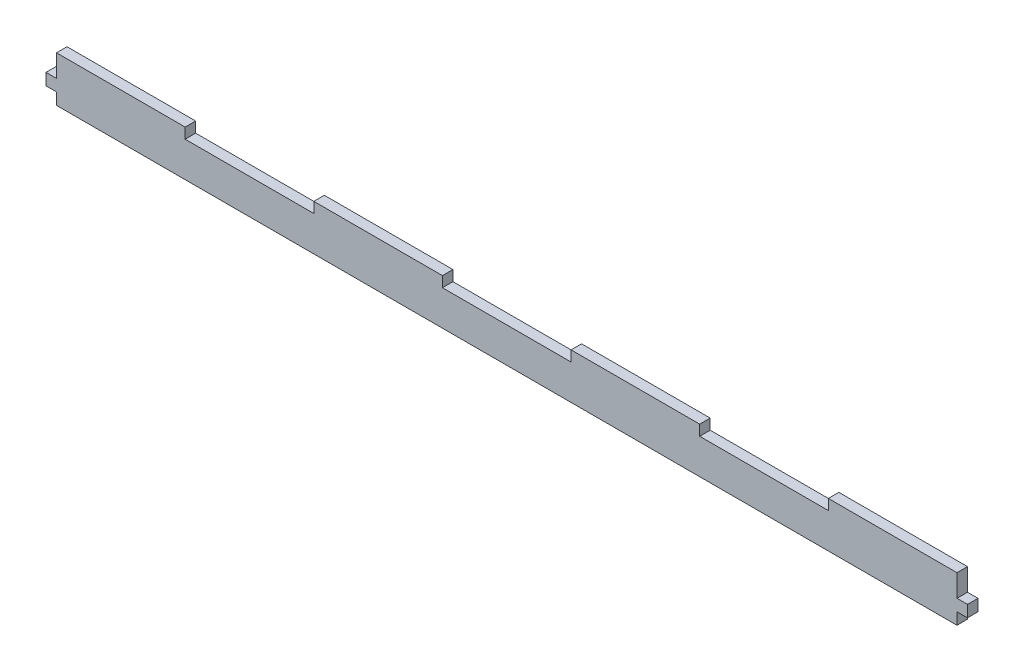
ISO-10303-21;
HEADER;
FILE_DESCRIPTION(('STEP AP214'),'2;1');
FILE_NAME('part.step','',(''),(''),'','','');
FILE_SCHEMA(('AUTOMOTIVE_DESIGN { 1 0 10303 214 1 1 1 1 }'));
ENDSEC;
DATA;
#1=APPLICATION_CONTEXT('core data for automotive mechanical design processes');
#2=APPLICATION_PROTOCOL_DEFINITION('international standard','automotive_design',2000,#1);
#3=PRODUCT_CONTEXT('',#1,'mechanical');
#4=PRODUCT('Part','Part','',(#3));
#5=PRODUCT_RELATED_PRODUCT_CATEGORY('part','',(#4));
#6=PRODUCT_DEFINITION_FORMATION('','',#4);
#7=PRODUCT_DEFINITION_CONTEXT('part definition',#1,'design');
#8=PRODUCT_DEFINITION('design','',#6,#7);
#9=PRODUCT_DEFINITION_SHAPE('','',#8);
#10=(LENGTH_UNIT() NAMED_UNIT(*) SI_UNIT(.MILLI.,.METRE.));
#11=(NAMED_UNIT(*) PLANE_ANGLE_UNIT() SI_UNIT($,.RADIAN.));
#12=(NAMED_UNIT(*) SI_UNIT($,.STERADIAN.) SOLID_ANGLE_UNIT());
#13=UNCERTAINTY_MEASURE_WITH_UNIT(LENGTH_MEASURE(1.E-05),#10,'distance_accuracy_value','');
#14=(GEOMETRIC_REPRESENTATION_CONTEXT(3) GLOBAL_UNCERTAINTY_ASSIGNED_CONTEXT((#13)) GLOBAL_UNIT_ASSIGNED_CONTEXT((#10,
#11,#12)) REPRESENTATION_CONTEXT('',''));
#15=CARTESIAN_POINT('',(0.,0.,0.));
#16=DIRECTION('',(0.,0.,1.));
#17=DIRECTION('',(1.,0.,0.));
#18=AXIS2_PLACEMENT_3D('',#15,#16,#17);
#19=CARTESIAN_POINT('',(257.,-14.,0.));
#20=DIRECTION('',(1.,0.,0.));
#21=DIRECTION('',(0.,0.,-1.));
#22=AXIS2_PLACEMENT_3D('',#19,#20,#21);
#23=PLANE('',#22);
#24=DIRECTION('',(0.,0.,1.));
#25=VECTOR('',#24,1.);
#26=CARTESIAN_POINT('',(257.,-0.666666666666655,0.));
#27=LINE('',#26,#25);
#28=CARTESIAN_POINT('',(257.,-0.666666666666668,-93.25));
#29=VERTEX_POINT('',#28);
#30=CARTESIAN_POINT('',(257.,-0.666666666666668,-87.25));
#31=VERTEX_POINT('',#30);
#32=EDGE_CURVE('E224',#29,#31,#27,.T.);
#33=ORIENTED_EDGE('',*,*,#32,.F.);
#34=DIRECTION('',(0.,1.,0.));
#35=VECTOR('',#34,1.);
#36=CARTESIAN_POINT('',(257.,-14.,-93.25));
#37=LINE('',#36,#35);
#38=CARTESIAN_POINT('',(257.,12.,-93.25));
#39=VERTEX_POINT('',#38);
#40=EDGE_CURVE('E449',#29,#39,#37,.T.);
#41=ORIENTED_EDGE('',*,*,#40,.T.);
#42=DIRECTION('',(0.,0.,-1.));
#43=VECTOR('',#42,1.);
#44=CARTESIAN_POINT('',(257.,12.,0.));
#45=LINE('',#44,#43);
#46=CARTESIAN_POINT('',(257.,12.,-87.25));
#47=VERTEX_POINT('',#46);
#48=EDGE_CURVE('E295',#47,#39,#45,.T.);
#49=ORIENTED_EDGE('',*,*,#48,.F.);
#50=DIRECTION('',(0.,1.,0.));
#51=VECTOR('',#50,1.);
#52=CARTESIAN_POINT('',(257.,-14.,-87.25));
#53=LINE('',#52,#51);
#54=EDGE_CURVE('E63',#31,#47,#53,.T.);
#55=ORIENTED_EDGE('',*,*,#54,.F.);
#56=EDGE_LOOP('',(#33,#41,#49,#55));
#57=FACE_BOUND('',#56,.T.);
#58=ADVANCED_FACE('F45',(#57),#23,.T.);
#59=CARTESIAN_POINT('',(-257.,-14.,0.));
#60=DIRECTION('',(-1.,0.,0.));
#61=DIRECTION('',(0.,0.,1.));
#62=AXIS2_PLACEMENT_3D('',#59,#60,#61);
#63=PLANE('',#62);
#64=DIRECTION('',(0.,1.,0.));
#65=VECTOR('',#64,1.);
#66=CARTESIAN_POINT('',(-257.,-14.,-93.2499999999999));
#67=LINE('',#66,#65);
#68=CARTESIAN_POINT('',(-257.,-0.666666666666669,-93.2499999999999));
#69=VERTEX_POINT('',#68);
#70=CARTESIAN_POINT('',(-257.,12.,-93.2499999999999));
#71=VERTEX_POINT('',#70);
#72=EDGE_CURVE('E446',#69,#71,#67,.T.);
#73=ORIENTED_EDGE('',*,*,#72,.F.);
#74=DIRECTION('',(0.,0.,1.));
#75=VECTOR('',#74,1.);
#76=CARTESIAN_POINT('',(-257.,-0.666666666666655,0.));
#77=LINE('',#76,#75);
#78=CARTESIAN_POINT('',(-257.,-0.666666666666668,-87.2499999999999));
#79=VERTEX_POINT('',#78);
#80=EDGE_CURVE('E227',#69,#79,#77,.T.);
#81=ORIENTED_EDGE('',*,*,#80,.T.);
#82=DIRECTION('',(0.,1.,0.));
#83=VECTOR('',#82,1.);
#84=CARTESIAN_POINT('',(-257.,-14.,-87.2499999999999));
#85=LINE('',#84,#83);
#86=CARTESIAN_POINT('',(-257.,12.,-87.2499999999999));
#87=VERTEX_POINT('',#86);
#88=EDGE_CURVE('E55',#79,#87,#85,.T.);
#89=ORIENTED_EDGE('',*,*,#88,.T.);
#90=DIRECTION('',(0.,0.,1.));
#91=VECTOR('',#90,1.);
#92=CARTESIAN_POINT('',(-257.,12.,0.));
#93=LINE('',#92,#91);
#94=EDGE_CURVE('E399',#71,#87,#93,.T.);
#95=ORIENTED_EDGE('',*,*,#94,.F.);
#96=EDGE_LOOP('',(#73,#81,#89,#95));
#97=FACE_BOUND('',#96,.T.);
#98=ADVANCED_FACE('F508',(#97),#63,.T.);
#99=CARTESIAN_POINT('',(-257.,-14.,-87.2499999999999));
#100=VERTEX_POINT('',#99);
#101=CARTESIAN_POINT('',(-257.,-7.33333333333333,-87.2499999999999));
#102=VERTEX_POINT('',#101);
#103=EDGE_CURVE('E11',#100,#102,#85,.T.);
#104=ORIENTED_EDGE('',*,*,#103,.T.);
#105=DIRECTION('',(0.,0.,-1.));
#106=VECTOR('',#105,1.);
#107=CARTESIAN_POINT('',(-257.,-7.33333333333333,0.));
#108=LINE('',#107,#106);
#109=CARTESIAN_POINT('',(-257.,-7.33333333333333,-93.2499999999999));
#110=VERTEX_POINT('',#109);
#111=EDGE_CURVE('E258',#102,#110,#108,.T.);
#112=ORIENTED_EDGE('',*,*,#111,.T.);
#113=CARTESIAN_POINT('',(-257.,-14.,-93.2499999999999));
#114=VERTEX_POINT('',#113);
#115=EDGE_CURVE('E443',#114,#110,#67,.T.);
#116=ORIENTED_EDGE('',*,*,#115,.F.);
#117=DIRECTION('',(0.,0.,1.));
#118=VECTOR('',#117,1.);
#119=CARTESIAN_POINT('',(-257.,-14.,0.));
#120=LINE('',#119,#118);
#121=EDGE_CURVE('E431',#114,#100,#120,.T.);
#122=ORIENTED_EDGE('',*,*,#121,.T.);
#123=EDGE_LOOP('',(#104,#112,#116,#122));
#124=FACE_BOUND('',#123,.T.);
#125=ADVANCED_FACE('F523',(#124),#63,.T.);
#126=CARTESIAN_POINT('',(0.,6.,0.));
#127=DIRECTION('',(0.,1.,0.));
#128=DIRECTION('',(0.,0.,1.));
#129=AXIS2_PLACEMENT_3D('',#126,#127,#128);
#130=PLANE('',#129);
#131=DIRECTION('',(0.,0.,-1.));
#132=VECTOR('',#131,1.);
#133=CARTESIAN_POINT('',(36.7142857142858,6.,0.));
#134=LINE('',#133,#132);
#135=CARTESIAN_POINT('',(36.7142857142858,6.,-87.25));
#136=VERTEX_POINT('',#135);
#137=CARTESIAN_POINT('',(36.7142857142858,6.,-93.25));
#138=VERTEX_POINT('',#137);
#139=EDGE_CURVE('E312',#136,#138,#134,.T.);
#140=ORIENTED_EDGE('',*,*,#139,.T.);
#141=DIRECTION('',(-1.,0.,0.));
#142=VECTOR('',#141,1.);
#143=CARTESIAN_POINT('',(0.,6.,-93.25));
#144=LINE('',#143,#142);
#145=CARTESIAN_POINT('',(-36.7142857142856,6.,-93.25));
#146=VERTEX_POINT('',#145);
#147=EDGE_CURVE('E441',#138,#146,#144,.T.);
#148=ORIENTED_EDGE('',*,*,#147,.T.);
#149=DIRECTION('',(0.,0.,1.));
#150=VECTOR('',#149,1.);
#151=CARTESIAN_POINT('',(-36.7142857142852,6.,1.69837688886108E-13));
#152=LINE('',#151,#150);
#153=CARTESIAN_POINT('',(-36.7142857142856,6.,-87.25));
#154=VERTEX_POINT('',#153);
#155=EDGE_CURVE('E357',#146,#154,#152,.T.);
#156=ORIENTED_EDGE('',*,*,#155,.T.);
#157=DIRECTION('',(-1.,0.,0.));
#158=VECTOR('',#157,1.);
#159=CARTESIAN_POINT('',(0.,6.,-87.25));
#160=LINE('',#159,#158);
#161=EDGE_CURVE('E439',#136,#154,#160,.T.);
#162=ORIENTED_EDGE('',*,*,#161,.F.);
#163=EDGE_LOOP('',(#140,#148,#156,#162));
#164=FACE_BOUND('',#163,.T.);
#165=ADVANCED_FACE('F482',(#164),#130,.T.);
#166=DIRECTION('',(0.,0.,-1.));
#167=VECTOR('',#166,1.);
#168=CARTESIAN_POINT('',(-110.142857142857,6.,0.));
#169=LINE('',#168,#167);
#170=CARTESIAN_POINT('',(-110.142857142857,6.,-87.25));
#171=VERTEX_POINT('',#170);
#172=CARTESIAN_POINT('',(-110.142857142857,6.,-93.2499999999999));
#173=VERTEX_POINT('',#172);
#174=EDGE_CURVE('E351',#171,#173,#169,.T.);
#175=ORIENTED_EDGE('',*,*,#174,.T.);
#176=CARTESIAN_POINT('',(-183.571428571428,6.,-93.2499999999999));
#177=VERTEX_POINT('',#176);
#178=EDGE_CURVE('E438',#173,#177,#144,.T.);
#179=ORIENTED_EDGE('',*,*,#178,.T.);
#180=DIRECTION('',(0.,0.,1.));
#181=VECTOR('',#180,1.);
#182=CARTESIAN_POINT('',(-183.571428571428,6.,0.));
#183=LINE('',#182,#181);
#184=CARTESIAN_POINT('',(-183.571428571428,6.,-87.2499999999999));
#185=VERTEX_POINT('',#184);
#186=EDGE_CURVE('E390',#177,#185,#183,.T.);
#187=ORIENTED_EDGE('',*,*,#186,.T.);
#188=EDGE_CURVE('E418',#171,#185,#160,.T.);
#189=ORIENTED_EDGE('',*,*,#188,.F.);
#190=EDGE_LOOP('',(#175,#179,#187,#189));
#191=FACE_BOUND('',#190,.T.);
#192=ADVANCED_FACE('F493',(#191),#130,.T.);
#193=DIRECTION('',(0.,0.,-1.));
#194=VECTOR('',#193,1.);
#195=CARTESIAN_POINT('',(183.571428571429,6.,0.));
#196=LINE('',#195,#194);
#197=CARTESIAN_POINT('',(183.571428571429,6.,-87.25));
#198=VERTEX_POINT('',#197);
#199=CARTESIAN_POINT('',(183.571428571429,6.,-93.25));
#200=VERTEX_POINT('',#199);
#201=EDGE_CURVE('E286',#198,#200,#196,.T.);
#202=ORIENTED_EDGE('',*,*,#201,.T.);
#203=CARTESIAN_POINT('',(110.142857142857,6.,-93.25));
#204=VERTEX_POINT('',#203);
#205=EDGE_CURVE('E423',#200,#204,#144,.T.);
#206=ORIENTED_EDGE('',*,*,#205,.T.);
#207=DIRECTION('',(0.,0.,1.));
#208=VECTOR('',#207,1.);
#209=CARTESIAN_POINT('',(110.142857142857,6.,0.));
#210=LINE('',#209,#208);
#211=CARTESIAN_POINT('',(110.142857142857,6.,-87.25));
#212=VERTEX_POINT('',#211);
#213=EDGE_CURVE('E318',#204,#212,#210,.T.);
#214=ORIENTED_EDGE('',*,*,#213,.T.);
#215=EDGE_CURVE('E435',#198,#212,#160,.T.);
#216=ORIENTED_EDGE('',*,*,#215,.F.);
#217=EDGE_LOOP('',(#202,#206,#214,#216));
#218=FACE_BOUND('',#217,.T.);
#219=ADVANCED_FACE('F468',(#218),#130,.T.);
#220=CARTESIAN_POINT('',(0.,-14.,-87.25));
#221=DIRECTION('',(0.,0.,-1.));
#222=DIRECTION('',(-1.,0.,0.));
#223=AXIS2_PLACEMENT_3D('',#220,#221,#222);
#224=PLANE('',#223);
#225=CARTESIAN_POINT('',(257.,-14.,-87.25));
#226=VERTEX_POINT('',#225);
#227=CARTESIAN_POINT('',(257.,-7.33333333333333,-87.25));
#228=VERTEX_POINT('',#227);
#229=EDGE_CURVE('E49',#226,#228,#53,.T.);
#230=ORIENTED_EDGE('',*,*,#229,.T.);
#231=DIRECTION('',(-1.,0.,0.));
#232=VECTOR('',#231,1.);
#233=CARTESIAN_POINT('',(263.,-7.33333333333333,-87.2499999999999));
#234=LINE('',#233,#232);
#235=CARTESIAN_POINT('',(263.,-7.33333333333333,-87.2499999999999));
#236=VERTEX_POINT('',#235);
#237=EDGE_CURVE('E228',#236,#228,#234,.T.);
#238=ORIENTED_EDGE('',*,*,#237,.F.);
#239=DIRECTION('',(0.,1.,0.));
#240=VECTOR('',#239,1.);
#241=CARTESIAN_POINT('',(263.,0.,-87.2499999999999));
#242=LINE('',#241,#240);
#243=CARTESIAN_POINT('',(263.,-0.666666666666668,-87.2499999999999));
#244=VERTEX_POINT('',#243);
#245=EDGE_CURVE('E214',#236,#244,#242,.T.);
#246=ORIENTED_EDGE('',*,*,#245,.T.);
#247=DIRECTION('',(-1.,0.,0.));
#248=VECTOR('',#247,1.);
#249=CARTESIAN_POINT('',(263.,-0.666666666666668,-87.2499999999999));
#250=LINE('',#249,#248);
#251=EDGE_CURVE('E222',#244,#31,#250,.T.);
#252=ORIENTED_EDGE('',*,*,#251,.T.);
#253=ORIENTED_EDGE('',*,*,#54,.T.);
#254=DIRECTION('',(-1.,0.,0.));
#255=VECTOR('',#254,1.);
#256=CARTESIAN_POINT('',(0.,12.,-87.25));
#257=LINE('',#256,#255);
#258=CARTESIAN_POINT('',(183.571428571429,12.,-87.25));
#259=VERTEX_POINT('',#258);
#260=EDGE_CURVE('E291',#47,#259,#257,.T.);
#261=ORIENTED_EDGE('',*,*,#260,.T.);
#262=DIRECTION('',(0.,-1.,0.));
#263=VECTOR('',#262,1.);
#264=CARTESIAN_POINT('',(183.571428571429,12.,-87.25));
#265=LINE('',#264,#263);
#266=EDGE_CURVE('E308',#259,#198,#265,.T.);
#267=ORIENTED_EDGE('',*,*,#266,.T.);
#268=ORIENTED_EDGE('',*,*,#215,.T.);
#269=DIRECTION('',(0.,-1.,0.));
#270=VECTOR('',#269,1.);
#271=CARTESIAN_POINT('',(110.142857142857,12.,-87.25));
#272=LINE('',#271,#270);
#273=CARTESIAN_POINT('',(110.142857142857,12.,-87.25));
#274=VERTEX_POINT('',#273);
#275=EDGE_CURVE('E343',#274,#212,#272,.T.);
#276=ORIENTED_EDGE('',*,*,#275,.F.);
#277=DIRECTION('',(-1.,0.,0.));
#278=VECTOR('',#277,1.);
#279=CARTESIAN_POINT('',(0.,12.,-87.25));
#280=LINE('',#279,#278);
#281=CARTESIAN_POINT('',(36.7142857142858,12.,-87.25));
#282=VERTEX_POINT('',#281);
#283=EDGE_CURVE('E317',#274,#282,#280,.T.);
#284=ORIENTED_EDGE('',*,*,#283,.T.);
#285=DIRECTION('',(0.,-1.,0.));
#286=VECTOR('',#285,1.);
#287=CARTESIAN_POINT('',(36.7142857142858,12.,-87.25));
#288=LINE('',#287,#286);
#289=EDGE_CURVE('E347',#282,#136,#288,.T.);
#290=ORIENTED_EDGE('',*,*,#289,.T.);
#291=ORIENTED_EDGE('',*,*,#161,.T.);
#292=DIRECTION('',(0.,-1.,0.));
#293=VECTOR('',#292,1.);
#294=CARTESIAN_POINT('',(-36.7142857142856,12.,-87.25));
#295=LINE('',#294,#293);
#296=CARTESIAN_POINT('',(-36.7142857142856,12.,-87.25));
#297=VERTEX_POINT('',#296);
#298=EDGE_CURVE('E382',#297,#154,#295,.T.);
#299=ORIENTED_EDGE('',*,*,#298,.F.);
#300=DIRECTION('',(-1.,0.,0.));
#301=VECTOR('',#300,1.);
#302=CARTESIAN_POINT('',(0.,12.,-87.25));
#303=LINE('',#302,#301);
#304=CARTESIAN_POINT('',(-110.142857142857,12.,-87.25));
#305=VERTEX_POINT('',#304);
#306=EDGE_CURVE('E356',#297,#305,#303,.T.);
#307=ORIENTED_EDGE('',*,*,#306,.T.);
#308=DIRECTION('',(0.,-1.,0.));
#309=VECTOR('',#308,1.);
#310=CARTESIAN_POINT('',(-110.142857142857,12.,-87.25));
#311=LINE('',#310,#309);
#312=EDGE_CURVE('E386',#305,#171,#311,.T.);
#313=ORIENTED_EDGE('',*,*,#312,.T.);
#314=ORIENTED_EDGE('',*,*,#188,.T.);
#315=DIRECTION('',(0.,-1.,0.));
#316=VECTOR('',#315,1.);
#317=CARTESIAN_POINT('',(-183.571428571428,12.,-87.2499999999999));
#318=LINE('',#317,#316);
#319=CARTESIAN_POINT('',(-183.571428571428,12.,-87.2499999999999));
#320=VERTEX_POINT('',#319);
#321=EDGE_CURVE('E407',#320,#185,#318,.T.);
#322=ORIENTED_EDGE('',*,*,#321,.F.);
#323=DIRECTION('',(-1.,0.,0.));
#324=VECTOR('',#323,1.);
#325=CARTESIAN_POINT('',(0.,12.,-87.25));
#326=LINE('',#325,#324);
#327=EDGE_CURVE('E403',#320,#87,#326,.T.);
#328=ORIENTED_EDGE('',*,*,#327,.T.);
#329=ORIENTED_EDGE('',*,*,#88,.F.);
#330=DIRECTION('',(1.,0.,0.));
#331=VECTOR('',#330,1.);
#332=CARTESIAN_POINT('',(-263.,-0.666666666666668,-87.2499999999999));
#333=LINE('',#332,#331);
#334=CARTESIAN_POINT('',(-263.,-0.666666666666668,-87.2499999999999));
#335=VERTEX_POINT('',#334);
#336=EDGE_CURVE('E268',#335,#79,#333,.T.);
#337=ORIENTED_EDGE('',*,*,#336,.F.);
#338=DIRECTION('',(0.,1.,0.));
#339=VECTOR('',#338,1.);
#340=CARTESIAN_POINT('',(-263.,0.,-87.2499999999999));
#341=LINE('',#340,#339);
#342=CARTESIAN_POINT('',(-263.,-7.33333333333333,-87.2499999999999));
#343=VERTEX_POINT('',#342);
#344=EDGE_CURVE('E265',#343,#335,#341,.T.);
#345=ORIENTED_EDGE('',*,*,#344,.F.);
#346=DIRECTION('',(1.,0.,0.));
#347=VECTOR('',#346,1.);
#348=CARTESIAN_POINT('',(-263.,-7.33333333333333,-87.2499999999999));
#349=LINE('',#348,#347);
#350=EDGE_CURVE('E277',#343,#102,#349,.T.);
#351=ORIENTED_EDGE('',*,*,#350,.T.);
#352=ORIENTED_EDGE('',*,*,#103,.F.);
#353=DIRECTION('',(-1.,0.,0.));
#354=VECTOR('',#353,1.);
#355=CARTESIAN_POINT('',(0.,-14.,-87.25));
#356=LINE('',#355,#354);
#357=EDGE_CURVE('E419',#226,#100,#356,.T.);
#358=ORIENTED_EDGE('',*,*,#357,.F.);
#359=EDGE_LOOP('',(#230,#238,#246,#252,#253,#261,#267,#268,#276,#284,#290,#291,#299,#307,#313,
#314,#322,#328,#329,#337,#345,#351,#352,#358));
#360=FACE_BOUND('',#359,.T.);
#361=ADVANCED_FACE('F47',(#360),#224,.F.);
#362=CARTESIAN_POINT('',(0.,-14.,-93.25));
#363=DIRECTION('',(0.,0.,-1.));
#364=DIRECTION('',(-1.,0.,0.));
#365=AXIS2_PLACEMENT_3D('',#362,#363,#364);
#366=PLANE('',#365);
#367=ORIENTED_EDGE('',*,*,#205,.F.);
#368=DIRECTION('',(0.,-1.,0.));
#369=VECTOR('',#368,1.);
#370=CARTESIAN_POINT('',(183.571428571429,12.,-93.25));
#371=LINE('',#370,#369);
#372=CARTESIAN_POINT('',(183.571428571429,12.,-93.25));
#373=VERTEX_POINT('',#372);
#374=EDGE_CURVE('E302',#373,#200,#371,.T.);
#375=ORIENTED_EDGE('',*,*,#374,.F.);
#376=DIRECTION('',(-1.,0.,0.));
#377=VECTOR('',#376,1.);
#378=CARTESIAN_POINT('',(0.,12.,-93.25));
#379=LINE('',#378,#377);
#380=EDGE_CURVE('E299',#39,#373,#379,.T.);
#381=ORIENTED_EDGE('',*,*,#380,.F.);
#382=ORIENTED_EDGE('',*,*,#40,.F.);
#383=DIRECTION('',(-1.,0.,0.));
#384=VECTOR('',#383,1.);
#385=CARTESIAN_POINT('',(263.,-0.666666666666669,-93.2499999999999));
#386=LINE('',#385,#384);
#387=CARTESIAN_POINT('',(263.,-0.666666666666669,-93.2499999999999));
#388=VERTEX_POINT('',#387);
#389=EDGE_CURVE('E240',#388,#29,#386,.T.);
#390=ORIENTED_EDGE('',*,*,#389,.F.);
#391=DIRECTION('',(0.,-1.,0.));
#392=VECTOR('',#391,1.);
#393=CARTESIAN_POINT('',(263.,0.,-93.2499999999999));
#394=LINE('',#393,#392);
#395=CARTESIAN_POINT('',(263.,-7.33333333333333,-93.2499999999999));
#396=VERTEX_POINT('',#395);
#397=EDGE_CURVE('E216',#388,#396,#394,.T.);
#398=ORIENTED_EDGE('',*,*,#397,.T.);
#399=DIRECTION('',(-1.,0.,0.));
#400=VECTOR('',#399,1.);
#401=CARTESIAN_POINT('',(263.,-7.33333333333333,-93.2499999999999));
#402=LINE('',#401,#400);
#403=CARTESIAN_POINT('',(257.,-7.33333333333333,-93.2499999999999));
#404=VERTEX_POINT('',#403);
#405=EDGE_CURVE('E247',#396,#404,#402,.T.);
#406=ORIENTED_EDGE('',*,*,#405,.T.);
#407=CARTESIAN_POINT('',(257.,-14.,-93.25));
#408=VERTEX_POINT('',#407);
#409=EDGE_CURVE('E447',#408,#404,#37,.T.);
#410=ORIENTED_EDGE('',*,*,#409,.F.);
#411=DIRECTION('',(-1.,0.,0.));
#412=VECTOR('',#411,1.);
#413=CARTESIAN_POINT('',(0.,-14.,-93.25));
#414=LINE('',#413,#412);
#415=EDGE_CURVE('E427',#408,#114,#414,.T.);
#416=ORIENTED_EDGE('',*,*,#415,.T.);
#417=ORIENTED_EDGE('',*,*,#115,.T.);
#418=DIRECTION('',(1.,0.,0.));
#419=VECTOR('',#418,1.);
#420=CARTESIAN_POINT('',(-263.,-7.33333333333333,-93.2499999999999));
#421=LINE('',#420,#419);
#422=CARTESIAN_POINT('',(-263.,-7.33333333333333,-93.2499999999999));
#423=VERTEX_POINT('',#422);
#424=EDGE_CURVE('E280',#423,#110,#421,.T.);
#425=ORIENTED_EDGE('',*,*,#424,.F.);
#426=DIRECTION('',(0.,-1.,0.));
#427=VECTOR('',#426,1.);
#428=CARTESIAN_POINT('',(-263.,0.,-93.2499999999999));
#429=LINE('',#428,#427);
#430=CARTESIAN_POINT('',(-263.,-0.666666666666669,-93.2499999999999));
#431=VERTEX_POINT('',#430);
#432=EDGE_CURVE('E257',#431,#423,#429,.T.);
#433=ORIENTED_EDGE('',*,*,#432,.F.);
#434=DIRECTION('',(1.,0.,0.));
#435=VECTOR('',#434,1.);
#436=CARTESIAN_POINT('',(-263.,-0.666666666666669,-93.2499999999999));
#437=LINE('',#436,#435);
#438=EDGE_CURVE('E283',#431,#69,#437,.T.);
#439=ORIENTED_EDGE('',*,*,#438,.T.);
#440=ORIENTED_EDGE('',*,*,#72,.T.);
#441=DIRECTION('',(-1.,0.,0.));
#442=VECTOR('',#441,1.);
#443=CARTESIAN_POINT('',(0.,12.,-93.25));
#444=LINE('',#443,#442);
#445=CARTESIAN_POINT('',(-183.571428571428,12.,-93.2499999999999));
#446=VERTEX_POINT('',#445);
#447=EDGE_CURVE('E395',#446,#71,#444,.T.);
#448=ORIENTED_EDGE('',*,*,#447,.F.);
#449=DIRECTION('',(0.,-1.,0.));
#450=VECTOR('',#449,1.);
#451=CARTESIAN_POINT('',(-183.571428571428,12.,-93.2499999999999));
#452=LINE('',#451,#450);
#453=EDGE_CURVE('E414',#446,#177,#452,.T.);
#454=ORIENTED_EDGE('',*,*,#453,.T.);
#455=ORIENTED_EDGE('',*,*,#178,.F.);
#456=DIRECTION('',(0.,-1.,0.));
#457=VECTOR('',#456,1.);
#458=CARTESIAN_POINT('',(-110.142857142857,12.,-93.2499999999999));
#459=LINE('',#458,#457);
#460=CARTESIAN_POINT('',(-110.142857142857,12.,-93.2499999999999));
#461=VERTEX_POINT('',#460);
#462=EDGE_CURVE('E368',#461,#173,#459,.T.);
#463=ORIENTED_EDGE('',*,*,#462,.F.);
#464=DIRECTION('',(-1.,0.,0.));
#465=VECTOR('',#464,1.);
#466=CARTESIAN_POINT('',(0.,12.,-93.25));
#467=LINE('',#466,#465);
#468=CARTESIAN_POINT('',(-36.7142857142856,12.,-93.25));
#469=VERTEX_POINT('',#468);
#470=EDGE_CURVE('E365',#469,#461,#467,.T.);
#471=ORIENTED_EDGE('',*,*,#470,.F.);
#472=DIRECTION('',(0.,-1.,0.));
#473=VECTOR('',#472,1.);
#474=CARTESIAN_POINT('',(-36.7142857142856,12.,-93.25));
#475=LINE('',#474,#473);
#476=EDGE_CURVE('E378',#469,#146,#475,.T.);
#477=ORIENTED_EDGE('',*,*,#476,.T.);
#478=ORIENTED_EDGE('',*,*,#147,.F.);
#479=DIRECTION('',(0.,-1.,0.));
#480=VECTOR('',#479,1.);
#481=CARTESIAN_POINT('',(36.7142857142858,12.,-93.25));
#482=LINE('',#481,#480);
#483=CARTESIAN_POINT('',(36.7142857142858,12.,-93.25));
#484=VERTEX_POINT('',#483);
#485=EDGE_CURVE('E329',#484,#138,#482,.T.);
#486=ORIENTED_EDGE('',*,*,#485,.F.);
#487=DIRECTION('',(-1.,0.,0.));
#488=VECTOR('',#487,1.);
#489=CARTESIAN_POINT('',(0.,12.,-93.25));
#490=LINE('',#489,#488);
#491=CARTESIAN_POINT('',(110.142857142857,12.,-93.25));
#492=VERTEX_POINT('',#491);
#493=EDGE_CURVE('E326',#492,#484,#490,.T.);
#494=ORIENTED_EDGE('',*,*,#493,.F.);
#495=DIRECTION('',(0.,-1.,0.));
#496=VECTOR('',#495,1.);
#497=CARTESIAN_POINT('',(110.142857142857,12.,-93.25));
#498=LINE('',#497,#496);
#499=EDGE_CURVE('E339',#492,#204,#498,.T.);
#500=ORIENTED_EDGE('',*,*,#499,.T.);
#501=EDGE_LOOP('',(#367,#375,#381,#382,#390,#398,#406,#410,#416,#417,#425,#433,#439,#440,#448,
#454,#455,#463,#471,#477,#478,#486,#494,#500));
#502=FACE_BOUND('',#501,.T.);
#503=ADVANCED_FACE('F498',(#502),#366,.T.);
#504=DIRECTION('',(0.,0.,-1.));
#505=VECTOR('',#504,1.);
#506=CARTESIAN_POINT('',(257.,-7.33333333333333,0.));
#507=LINE('',#506,#505);
#508=EDGE_CURVE('E71',#228,#404,#507,.T.);
#509=ORIENTED_EDGE('',*,*,#508,.F.);
#510=ORIENTED_EDGE('',*,*,#229,.F.);
#511=DIRECTION('',(0.,0.,-1.));
#512=VECTOR('',#511,1.);
#513=CARTESIAN_POINT('',(257.,-14.,0.));
#514=LINE('',#513,#512);
#515=EDGE_CURVE('E422',#226,#408,#514,.T.);
#516=ORIENTED_EDGE('',*,*,#515,.T.);
#517=ORIENTED_EDGE('',*,*,#409,.T.);
#518=EDGE_LOOP('',(#509,#510,#516,#517));
#519=FACE_BOUND('',#518,.T.);
#520=ADVANCED_FACE('F529',(#519),#23,.T.);
#521=CARTESIAN_POINT('',(0.,-14.,0.));
#522=DIRECTION('',(0.,1.,0.));
#523=DIRECTION('',(0.,0.,1.));
#524=AXIS2_PLACEMENT_3D('',#521,#522,#523);
#525=PLANE('',#524);
#526=ORIENTED_EDGE('',*,*,#357,.T.);
#527=ORIENTED_EDGE('',*,*,#121,.F.);
#528=ORIENTED_EDGE('',*,*,#415,.F.);
#529=ORIENTED_EDGE('',*,*,#515,.F.);
#530=EDGE_LOOP('',(#526,#527,#528,#529));
#531=FACE_BOUND('',#530,.T.);
#532=ADVANCED_FACE('F527',(#531),#525,.F.);
#533=CARTESIAN_POINT('',(-183.571428571428,12.,0.));
#534=DIRECTION('',(1.,0.,0.));
#535=DIRECTION('',(0.,0.,-1.));
#536=AXIS2_PLACEMENT_3D('',#533,#534,#535);
#537=PLANE('',#536);
#538=ORIENTED_EDGE('',*,*,#186,.F.);
#539=ORIENTED_EDGE('',*,*,#453,.F.);
#540=DIRECTION('',(0.,0.,1.));
#541=VECTOR('',#540,1.);
#542=CARTESIAN_POINT('',(-183.571428571428,12.,0.));
#543=LINE('',#542,#541);
#544=EDGE_CURVE('E391',#446,#320,#543,.T.);
#545=ORIENTED_EDGE('',*,*,#544,.T.);
#546=ORIENTED_EDGE('',*,*,#321,.T.);
#547=EDGE_LOOP('',(#538,#539,#545,#546));
#548=FACE_BOUND('',#547,.T.);
#549=ADVANCED_FACE('F490',(#548),#537,.T.);
#550=CARTESIAN_POINT('',(0.,12.,0.));
#551=DIRECTION('',(0.,1.,0.));
#552=DIRECTION('',(0.,0.,1.));
#553=AXIS2_PLACEMENT_3D('',#550,#551,#552);
#554=PLANE('',#553);
#555=ORIENTED_EDGE('',*,*,#544,.F.);
#556=ORIENTED_EDGE('',*,*,#447,.T.);
#557=ORIENTED_EDGE('',*,*,#94,.T.);
#558=ORIENTED_EDGE('',*,*,#327,.F.);
#559=EDGE_LOOP('',(#555,#556,#557,#558));
#560=FACE_BOUND('',#559,.T.);
#561=ADVANCED_FACE('F502',(#560),#554,.T.);
#562=CARTESIAN_POINT('',(-110.142857142857,12.,0.));
#563=DIRECTION('',(-1.,0.,0.));
#564=DIRECTION('',(0.,0.,1.));
#565=AXIS2_PLACEMENT_3D('',#562,#563,#564);
#566=PLANE('',#565);
#567=ORIENTED_EDGE('',*,*,#174,.F.);
#568=ORIENTED_EDGE('',*,*,#312,.F.);
#569=DIRECTION('',(0.,0.,-1.));
#570=VECTOR('',#569,1.);
#571=CARTESIAN_POINT('',(-110.142857142857,12.,0.));
#572=LINE('',#571,#570);
#573=EDGE_CURVE('E352',#305,#461,#572,.T.);
#574=ORIENTED_EDGE('',*,*,#573,.T.);
#575=ORIENTED_EDGE('',*,*,#462,.T.);
#576=EDGE_LOOP('',(#567,#568,#574,#575));
#577=FACE_BOUND('',#576,.T.);
#578=ADVANCED_FACE('F552',(#577),#566,.T.);
#579=CARTESIAN_POINT('',(-36.7142857142852,12.,1.69837688886108E-13));
#580=DIRECTION('',(1.,0.,0.));
#581=DIRECTION('',(0.,0.,-1.));
#582=AXIS2_PLACEMENT_3D('',#579,#580,#581);
#583=PLANE('',#582);
#584=ORIENTED_EDGE('',*,*,#155,.F.);
#585=ORIENTED_EDGE('',*,*,#476,.F.);
#586=DIRECTION('',(0.,0.,1.));
#587=VECTOR('',#586,1.);
#588=CARTESIAN_POINT('',(-36.7142857142852,12.,1.69837688886108E-13));
#589=LINE('',#588,#587);
#590=EDGE_CURVE('E361',#469,#297,#589,.T.);
#591=ORIENTED_EDGE('',*,*,#590,.T.);
#592=ORIENTED_EDGE('',*,*,#298,.T.);
#593=EDGE_LOOP('',(#584,#585,#591,#592));
#594=FACE_BOUND('',#593,.T.);
#595=ADVANCED_FACE('F555',(#594),#583,.T.);
#596=CARTESIAN_POINT('',(0.,12.,0.));
#597=DIRECTION('',(0.,1.,0.));
#598=DIRECTION('',(0.,0.,1.));
#599=AXIS2_PLACEMENT_3D('',#596,#597,#598);
#600=PLANE('',#599);
#601=ORIENTED_EDGE('',*,*,#573,.F.);
#602=ORIENTED_EDGE('',*,*,#306,.F.);
#603=ORIENTED_EDGE('',*,*,#590,.F.);
#604=ORIENTED_EDGE('',*,*,#470,.T.);
#605=EDGE_LOOP('',(#601,#602,#603,#604));
#606=FACE_BOUND('',#605,.T.);
#607=ADVANCED_FACE('F559',(#606),#600,.T.);
#608=CARTESIAN_POINT('',(36.7142857142858,12.,0.));
#609=DIRECTION('',(-1.,0.,0.));
#610=DIRECTION('',(0.,0.,1.));
#611=AXIS2_PLACEMENT_3D('',#608,#609,#610);
#612=PLANE('',#611);
#613=ORIENTED_EDGE('',*,*,#139,.F.);
#614=ORIENTED_EDGE('',*,*,#289,.F.);
#615=DIRECTION('',(0.,0.,-1.));
#616=VECTOR('',#615,1.);
#617=CARTESIAN_POINT('',(36.7142857142858,12.,0.));
#618=LINE('',#617,#616);
#619=EDGE_CURVE('E313',#282,#484,#618,.T.);
#620=ORIENTED_EDGE('',*,*,#619,.T.);
#621=ORIENTED_EDGE('',*,*,#485,.T.);
#622=EDGE_LOOP('',(#613,#614,#620,#621));
#623=FACE_BOUND('',#622,.T.);
#624=ADVANCED_FACE('F480',(#623),#612,.T.);
#625=CARTESIAN_POINT('',(110.142857142857,12.,0.));
#626=DIRECTION('',(1.,0.,0.));
#627=DIRECTION('',(0.,0.,-1.));
#628=AXIS2_PLACEMENT_3D('',#625,#626,#627);
#629=PLANE('',#628);
#630=ORIENTED_EDGE('',*,*,#213,.F.);
#631=ORIENTED_EDGE('',*,*,#499,.F.);
#632=DIRECTION('',(0.,0.,1.));
#633=VECTOR('',#632,1.);
#634=CARTESIAN_POINT('',(110.142857142857,12.,0.));
#635=LINE('',#634,#633);
#636=EDGE_CURVE('E322',#492,#274,#635,.T.);
#637=ORIENTED_EDGE('',*,*,#636,.T.);
#638=ORIENTED_EDGE('',*,*,#275,.T.);
#639=EDGE_LOOP('',(#630,#631,#637,#638));
#640=FACE_BOUND('',#639,.T.);
#641=ADVANCED_FACE('F471',(#640),#629,.T.);
#642=CARTESIAN_POINT('',(0.,12.,0.));
#643=DIRECTION('',(0.,1.,0.));
#644=DIRECTION('',(0.,0.,1.));
#645=AXIS2_PLACEMENT_3D('',#642,#643,#644);
#646=PLANE('',#645);
#647=ORIENTED_EDGE('',*,*,#619,.F.);
#648=ORIENTED_EDGE('',*,*,#283,.F.);
#649=ORIENTED_EDGE('',*,*,#636,.F.);
#650=ORIENTED_EDGE('',*,*,#493,.T.);
#651=EDGE_LOOP('',(#647,#648,#649,#650));
#652=FACE_BOUND('',#651,.T.);
#653=ADVANCED_FACE('F476',(#652),#646,.T.);
#654=CARTESIAN_POINT('',(183.571428571429,12.,0.));
#655=DIRECTION('',(-1.,0.,0.));
#656=DIRECTION('',(0.,0.,1.));
#657=AXIS2_PLACEMENT_3D('',#654,#655,#656);
#658=PLANE('',#657);
#659=ORIENTED_EDGE('',*,*,#201,.F.);
#660=ORIENTED_EDGE('',*,*,#266,.F.);
#661=DIRECTION('',(0.,0.,-1.));
#662=VECTOR('',#661,1.);
#663=CARTESIAN_POINT('',(183.571428571429,12.,0.));
#664=LINE('',#663,#662);
#665=EDGE_CURVE('E287',#259,#373,#664,.T.);
#666=ORIENTED_EDGE('',*,*,#665,.T.);
#667=ORIENTED_EDGE('',*,*,#374,.T.);
#668=EDGE_LOOP('',(#659,#660,#666,#667));
#669=FACE_BOUND('',#668,.T.);
#670=ADVANCED_FACE('F464',(#669),#658,.T.);
#671=CARTESIAN_POINT('',(0.,12.,0.));
#672=DIRECTION('',(0.,1.,0.));
#673=DIRECTION('',(0.,0.,1.));
#674=AXIS2_PLACEMENT_3D('',#671,#672,#673);
#675=PLANE('',#674);
#676=ORIENTED_EDGE('',*,*,#665,.F.);
#677=ORIENTED_EDGE('',*,*,#260,.F.);
#678=ORIENTED_EDGE('',*,*,#48,.T.);
#679=ORIENTED_EDGE('',*,*,#380,.T.);
#680=EDGE_LOOP('',(#676,#677,#678,#679));
#681=FACE_BOUND('',#680,.T.);
#682=ADVANCED_FACE('F460',(#681),#675,.T.);
#683=CARTESIAN_POINT('',(-263.,-0.666666666666655,0.));
#684=DIRECTION('',(0.,1.,0.));
#685=DIRECTION('',(0.,0.,1.));
#686=AXIS2_PLACEMENT_3D('',#683,#684,#685);
#687=PLANE('',#686);
#688=ORIENTED_EDGE('',*,*,#80,.F.);
#689=ORIENTED_EDGE('',*,*,#438,.F.);
#690=DIRECTION('',(0.,0.,1.));
#691=VECTOR('',#690,1.);
#692=CARTESIAN_POINT('',(-263.,-0.666666666666655,0.));
#693=LINE('',#692,#691);
#694=EDGE_CURVE('E253',#431,#335,#693,.T.);
#695=ORIENTED_EDGE('',*,*,#694,.T.);
#696=ORIENTED_EDGE('',*,*,#336,.T.);
#697=EDGE_LOOP('',(#688,#689,#695,#696));
#698=FACE_BOUND('',#697,.T.);
#699=ADVANCED_FACE('F511',(#698),#687,.T.);
#700=CARTESIAN_POINT('',(-263.,-7.33333333333333,0.));
#701=DIRECTION('',(0.,-1.,0.));
#702=DIRECTION('',(0.,0.,-1.));
#703=AXIS2_PLACEMENT_3D('',#700,#701,#702);
#704=PLANE('',#703);
#705=ORIENTED_EDGE('',*,*,#111,.F.);
#706=ORIENTED_EDGE('',*,*,#350,.F.);
#707=DIRECTION('',(0.,0.,-1.));
#708=VECTOR('',#707,1.);
#709=CARTESIAN_POINT('',(-263.,-7.33333333333333,0.));
#710=LINE('',#709,#708);
#711=EDGE_CURVE('E261',#343,#423,#710,.T.);
#712=ORIENTED_EDGE('',*,*,#711,.T.);
#713=ORIENTED_EDGE('',*,*,#424,.T.);
#714=EDGE_LOOP('',(#705,#706,#712,#713));
#715=FACE_BOUND('',#714,.T.);
#716=ADVANCED_FACE('F521',(#715),#704,.T.);
#717=CARTESIAN_POINT('',(-263.,0.,0.));
#718=DIRECTION('',(-1.,0.,0.));
#719=DIRECTION('',(0.,0.,1.));
#720=AXIS2_PLACEMENT_3D('',#717,#718,#719);
#721=PLANE('',#720);
#722=ORIENTED_EDGE('',*,*,#694,.F.);
#723=ORIENTED_EDGE('',*,*,#432,.T.);
#724=ORIENTED_EDGE('',*,*,#711,.F.);
#725=ORIENTED_EDGE('',*,*,#344,.T.);
#726=EDGE_LOOP('',(#722,#723,#724,#725));
#727=FACE_BOUND('',#726,.T.);
#728=ADVANCED_FACE('F515',(#727),#721,.T.);
#729=CARTESIAN_POINT('',(263.,-0.666666666666655,0.));
#730=DIRECTION('',(0.,-1.,0.));
#731=DIRECTION('',(0.,0.,-1.));
#732=AXIS2_PLACEMENT_3D('',#729,#730,#731);
#733=PLANE('',#732);
#734=ORIENTED_EDGE('',*,*,#32,.T.);
#735=ORIENTED_EDGE('',*,*,#251,.F.);
#736=DIRECTION('',(0.,0.,1.));
#737=VECTOR('',#736,1.);
#738=CARTESIAN_POINT('',(263.,-0.666666666666655,0.));
#739=LINE('',#738,#737);
#740=EDGE_CURVE('E210',#388,#244,#739,.T.);
#741=ORIENTED_EDGE('',*,*,#740,.F.);
#742=ORIENTED_EDGE('',*,*,#389,.T.);
#743=EDGE_LOOP('',(#734,#735,#741,#742));
#744=FACE_BOUND('',#743,.T.);
#745=ADVANCED_FACE('F223',(#744),#733,.F.);
#746=CARTESIAN_POINT('',(263.,-7.33333333333333,0.));
#747=DIRECTION('',(0.,1.,0.));
#748=DIRECTION('',(0.,0.,1.));
#749=AXIS2_PLACEMENT_3D('',#746,#747,#748);
#750=PLANE('',#749);
#751=ORIENTED_EDGE('',*,*,#508,.T.);
#752=ORIENTED_EDGE('',*,*,#405,.F.);
#753=DIRECTION('',(0.,0.,-1.));
#754=VECTOR('',#753,1.);
#755=CARTESIAN_POINT('',(263.,-7.33333333333333,0.));
#756=LINE('',#755,#754);
#757=EDGE_CURVE('E233',#236,#396,#756,.T.);
#758=ORIENTED_EDGE('',*,*,#757,.F.);
#759=ORIENTED_EDGE('',*,*,#237,.T.);
#760=EDGE_LOOP('',(#751,#752,#758,#759));
#761=FACE_BOUND('',#760,.T.);
#762=ADVANCED_FACE('F582',(#761),#750,.F.);
#763=CARTESIAN_POINT('',(263.,0.,0.));
#764=DIRECTION('',(1.,0.,0.));
#765=DIRECTION('',(0.,0.,1.));
#766=AXIS2_PLACEMENT_3D('',#763,#764,#765);
#767=PLANE('',#766);
#768=ORIENTED_EDGE('',*,*,#740,.T.);
#769=ORIENTED_EDGE('',*,*,#245,.F.);
#770=ORIENTED_EDGE('',*,*,#757,.T.);
#771=ORIENTED_EDGE('',*,*,#397,.F.);
#772=EDGE_LOOP('',(#768,#769,#770,#771));
#773=FACE_BOUND('',#772,.T.);
#774=ADVANCED_FACE('F212',(#773),#767,.T.);
#775=CLOSED_SHELL('',(#58,#98,#125,#165,#192,#219,#361,#503,#520,#532,#549,#561,#578,#595,#607,
#624,#641,#653,#670,#682,#699,#716,#728,#745,#762,#774));
#776=MANIFOLD_SOLID_BREP('B2',#775);
#777=ADVANCED_BREP_SHAPE_REPRESENTATION('',(#18,#776),#14);
#778=SHAPE_DEFINITION_REPRESENTATION(#9,#777);
ENDSEC;
END-ISO-10303-21;
